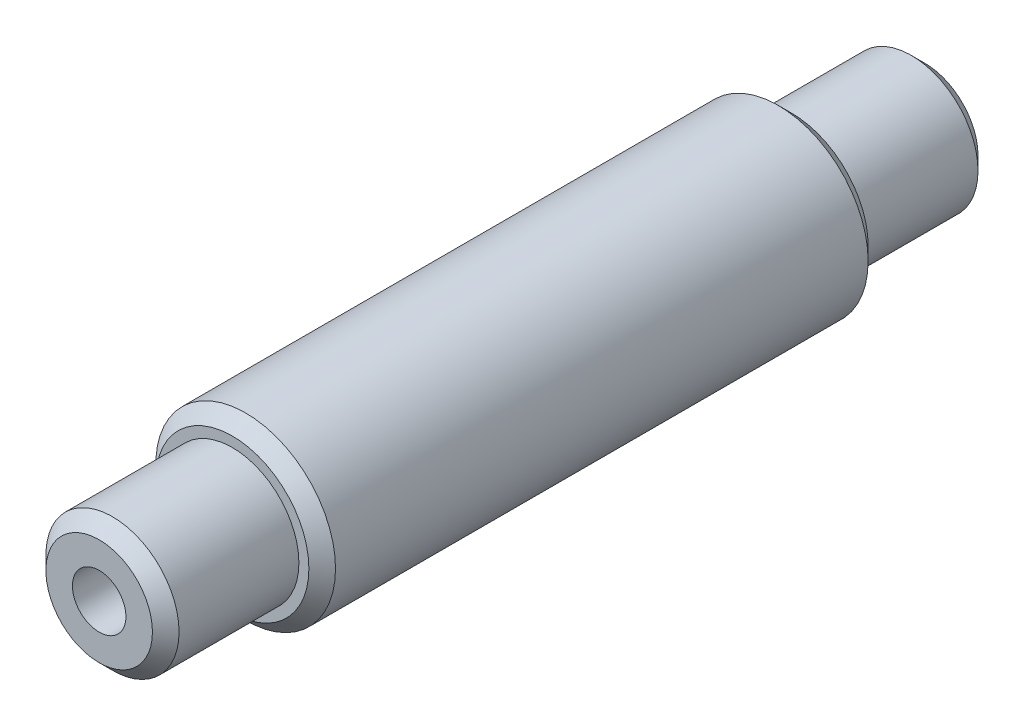
ISO-10303-21;
HEADER;
FILE_DESCRIPTION(('STEP AP214'),'2;1');
FILE_NAME('part.step','',(''),(''),'','','');
FILE_SCHEMA(('AUTOMOTIVE_DESIGN { 1 0 10303 214 1 1 1 1 }'));
ENDSEC;
DATA;
#1=APPLICATION_CONTEXT('core data for automotive mechanical design processes');
#2=APPLICATION_PROTOCOL_DEFINITION('international standard','automotive_design',2000,#1);
#3=PRODUCT_CONTEXT('',#1,'mechanical');
#4=PRODUCT('Part','Part','',(#3));
#5=PRODUCT_RELATED_PRODUCT_CATEGORY('part','',(#4));
#6=PRODUCT_DEFINITION_FORMATION('','',#4);
#7=PRODUCT_DEFINITION_CONTEXT('part definition',#1,'design');
#8=PRODUCT_DEFINITION('design','',#6,#7);
#9=PRODUCT_DEFINITION_SHAPE('','',#8);
#10=(LENGTH_UNIT() NAMED_UNIT(*) SI_UNIT(.MILLI.,.METRE.));
#11=(NAMED_UNIT(*) PLANE_ANGLE_UNIT() SI_UNIT($,.RADIAN.));
#12=(NAMED_UNIT(*) SI_UNIT($,.STERADIAN.) SOLID_ANGLE_UNIT());
#13=UNCERTAINTY_MEASURE_WITH_UNIT(LENGTH_MEASURE(1.E-05),#10,'distance_accuracy_value','');
#14=(GEOMETRIC_REPRESENTATION_CONTEXT(3) GLOBAL_UNCERTAINTY_ASSIGNED_CONTEXT((#13)) GLOBAL_UNIT_ASSIGNED_CONTEXT((#10,
#11,#12)) REPRESENTATION_CONTEXT('',''));
#15=CARTESIAN_POINT('',(0.,0.,0.));
#16=DIRECTION('',(0.,0.,1.));
#17=DIRECTION('',(1.,0.,0.));
#18=AXIS2_PLACEMENT_3D('',#15,#16,#17);
#19=CARTESIAN_POINT('',(0.,0.,26.67));
#20=DIRECTION('',(0.,0.,1.));
#21=DIRECTION('',(1.,0.,0.));
#22=AXIS2_PLACEMENT_3D('',#19,#20,#21);
#23=PLANE('',#22);
#24=CARTESIAN_POINT('',(0.,0.,26.67));
#25=DIRECTION('',(0.,0.,1.));
#26=DIRECTION('',(1.,0.,0.));
#27=AXIS2_PLACEMENT_3D('',#24,#25,#26);
#28=CIRCLE('',#27,7.30250000000001);
#29=CARTESIAN_POINT('',(7.30250000000001,0.,26.67));
#30=VERTEX_POINT('',#29);
#31=EDGE_CURVE('E94',#30,#30,#28,.T.);
#32=ORIENTED_EDGE('',*,*,#31,.T.);
#33=EDGE_LOOP('',(#32));
#34=FACE_BOUND('',#33,.T.);
#35=CARTESIAN_POINT('',(0.,0.,26.67));
#36=DIRECTION('',(0.,0.,1.));
#37=DIRECTION('',(1.,0.,0.));
#38=AXIS2_PLACEMENT_3D('',#35,#36,#37);
#39=CIRCLE('',#38,6.35);
#40=CARTESIAN_POINT('',(6.35,0.,26.67));
#41=VERTEX_POINT('',#40);
#42=EDGE_CURVE('E76',#41,#41,#39,.T.);
#43=ORIENTED_EDGE('',*,*,#42,.F.);
#44=EDGE_LOOP('',(#43));
#45=FACE_BOUND('',#44,.T.);
#46=ADVANCED_FACE('F38',(#34,#45),#23,.T.);
#47=CARTESIAN_POINT('',(0.,0.,-26.67));
#48=DIRECTION('',(0.,0.,1.));
#49=DIRECTION('',(1.,0.,0.));
#50=AXIS2_PLACEMENT_3D('',#47,#48,#49);
#51=PLANE('',#50);
#52=CARTESIAN_POINT('',(0.,0.,-26.67));
#53=DIRECTION('',(0.,0.,1.));
#54=DIRECTION('',(1.,0.,0.));
#55=AXIS2_PLACEMENT_3D('',#52,#53,#54);
#56=CIRCLE('',#55,7.3025);
#57=CARTESIAN_POINT('',(7.3025,0.,-26.67));
#58=VERTEX_POINT('',#57);
#59=EDGE_CURVE('E91',#58,#58,#56,.F.);
#60=ORIENTED_EDGE('',*,*,#59,.T.);
#61=EDGE_LOOP('',(#60));
#62=FACE_BOUND('',#61,.T.);
#63=CARTESIAN_POINT('',(0.,0.,-26.67));
#64=DIRECTION('',(0.,0.,1.));
#65=DIRECTION('',(1.,0.,0.));
#66=AXIS2_PLACEMENT_3D('',#63,#64,#65);
#67=CIRCLE('',#66,6.35);
#68=CARTESIAN_POINT('',(6.35,0.,-26.67));
#69=VERTEX_POINT('',#68);
#70=EDGE_CURVE('E73',#69,#69,#67,.F.);
#71=ORIENTED_EDGE('',*,*,#70,.F.);
#72=EDGE_LOOP('',(#71));
#73=FACE_BOUND('',#72,.T.);
#74=ADVANCED_FACE('F114',(#62,#73),#51,.F.);
#75=CARTESIAN_POINT('',(0.,0.,26.67));
#76=DIRECTION('',(0.,0.,-1.));
#77=DIRECTION('',(-1.,0.,0.));
#78=AXIS2_PLACEMENT_3D('',#75,#76,#77);
#79=CYLINDRICAL_SURFACE('',#78,8.5725);
#80=CARTESIAN_POINT('',(0.,0.,-25.4));
#81=DIRECTION('',(0.,0.,1.));
#82=DIRECTION('',(1.,0.,0.));
#83=AXIS2_PLACEMENT_3D('',#80,#81,#82);
#84=CIRCLE('',#83,8.5725);
#85=CARTESIAN_POINT('',(8.5725,0.,-25.4));
#86=VERTEX_POINT('',#85);
#87=EDGE_CURVE('E88',#86,#86,#84,.T.);
#88=ORIENTED_EDGE('',*,*,#87,.T.);
#89=EDGE_LOOP('',(#88));
#90=FACE_BOUND('',#89,.T.);
#91=CARTESIAN_POINT('',(0.,0.,25.4));
#92=DIRECTION('',(0.,0.,1.));
#93=DIRECTION('',(1.,0.,0.));
#94=AXIS2_PLACEMENT_3D('',#91,#92,#93);
#95=CIRCLE('',#94,8.5725);
#96=CARTESIAN_POINT('',(8.5725,0.,25.4));
#97=VERTEX_POINT('',#96);
#98=EDGE_CURVE('E85',#97,#97,#95,.F.);
#99=ORIENTED_EDGE('',*,*,#98,.T.);
#100=EDGE_LOOP('',(#99));
#101=FACE_BOUND('',#100,.T.);
#102=ADVANCED_FACE('F120',(#90,#101),#79,.T.);
#103=CARTESIAN_POINT('',(0.,0.,-39.37));
#104=DIRECTION('',(0.,0.,1.));
#105=DIRECTION('',(1.,0.,0.));
#106=AXIS2_PLACEMENT_3D('',#103,#104,#105);
#107=PLANE('',#106);
#108=CARTESIAN_POINT('',(0.,0.,-39.37));
#109=DIRECTION('',(0.,0.,-1.));
#110=DIRECTION('',(-1.,0.,0.));
#111=AXIS2_PLACEMENT_3D('',#108,#109,#110);
#112=CIRCLE('',#111,2.55269999999999);
#113=CARTESIAN_POINT('',(-2.55269999999999,0.,-39.37));
#114=VERTEX_POINT('',#113);
#115=EDGE_CURVE('E62',#114,#114,#112,.T.);
#116=ORIENTED_EDGE('',*,*,#115,.F.);
#117=EDGE_LOOP('',(#116));
#118=FACE_BOUND('',#117,.T.);
#119=CARTESIAN_POINT('',(0.,0.,-39.37));
#120=DIRECTION('',(0.,0.,1.));
#121=DIRECTION('',(1.,0.,0.));
#122=AXIS2_PLACEMENT_3D('',#119,#120,#121);
#123=CIRCLE('',#122,5.07999999999999);
#124=CARTESIAN_POINT('',(5.07999999999999,0.,-39.37));
#125=VERTEX_POINT('',#124);
#126=EDGE_CURVE('E82',#125,#125,#123,.F.);
#127=ORIENTED_EDGE('',*,*,#126,.T.);
#128=EDGE_LOOP('',(#127));
#129=FACE_BOUND('',#128,.T.);
#130=ADVANCED_FACE('F130',(#118,#129),#107,.F.);
#131=CARTESIAN_POINT('',(0.,0.,39.37));
#132=DIRECTION('',(0.,0.,-1.));
#133=DIRECTION('',(-1.,0.,0.));
#134=AXIS2_PLACEMENT_3D('',#131,#132,#133);
#135=CYLINDRICAL_SURFACE('',#134,6.35);
#136=CARTESIAN_POINT('',(0.,0.,-38.1));
#137=DIRECTION('',(0.,0.,1.));
#138=DIRECTION('',(1.,0.,0.));
#139=AXIS2_PLACEMENT_3D('',#136,#137,#138);
#140=CIRCLE('',#139,6.35);
#141=CARTESIAN_POINT('',(6.35,0.,-38.1));
#142=VERTEX_POINT('',#141);
#143=EDGE_CURVE('E79',#142,#142,#140,.T.);
#144=ORIENTED_EDGE('',*,*,#143,.T.);
#145=EDGE_LOOP('',(#144));
#146=FACE_BOUND('',#145,.T.);
#147=ORIENTED_EDGE('',*,*,#70,.T.);
#148=EDGE_LOOP('',(#147));
#149=FACE_BOUND('',#148,.T.);
#150=ADVANCED_FACE('F150',(#146,#149),#135,.T.);
#151=CARTESIAN_POINT('',(0.,0.,38.1));
#152=DIRECTION('',(0.,0.,1.));
#153=DIRECTION('',(1.,0.,0.));
#154=AXIS2_PLACEMENT_3D('',#151,#152,#153);
#155=CIRCLE('',#154,6.35);
#156=CARTESIAN_POINT('',(6.35,0.,38.1));
#157=VERTEX_POINT('',#156);
#158=EDGE_CURVE('E11',#157,#157,#155,.F.);
#159=ORIENTED_EDGE('',*,*,#158,.T.);
#160=EDGE_LOOP('',(#159));
#161=FACE_BOUND('',#160,.T.);
#162=ORIENTED_EDGE('',*,*,#42,.T.);
#163=EDGE_LOOP('',(#162));
#164=FACE_BOUND('',#163,.T.);
#165=ADVANCED_FACE('F125',(#161,#164),#135,.T.);
#166=CARTESIAN_POINT('',(0.,0.,39.37));
#167=DIRECTION('',(0.,0.,1.));
#168=DIRECTION('',(1.,0.,0.));
#169=AXIS2_PLACEMENT_3D('',#166,#167,#168);
#170=PLANE('',#169);
#171=CARTESIAN_POINT('',(0.,0.,39.37));
#172=DIRECTION('',(0.,0.,1.));
#173=DIRECTION('',(1.,0.,0.));
#174=AXIS2_PLACEMENT_3D('',#171,#172,#173);
#175=CIRCLE('',#174,2.55269999999999);
#176=CARTESIAN_POINT('',(2.55269999999999,0.,39.37));
#177=VERTEX_POINT('',#176);
#178=EDGE_CURVE('E63',#177,#177,#175,.T.);
#179=ORIENTED_EDGE('',*,*,#178,.F.);
#180=EDGE_LOOP('',(#179));
#181=FACE_BOUND('',#180,.T.);
#182=CARTESIAN_POINT('',(0.,0.,39.37));
#183=DIRECTION('',(0.,0.,1.));
#184=DIRECTION('',(1.,0.,0.));
#185=AXIS2_PLACEMENT_3D('',#182,#183,#184);
#186=CIRCLE('',#185,5.08000000000002);
#187=CARTESIAN_POINT('',(5.08000000000002,0.,39.37));
#188=VERTEX_POINT('',#187);
#189=EDGE_CURVE('E46',#188,#188,#186,.T.);
#190=ORIENTED_EDGE('',*,*,#189,.T.);
#191=EDGE_LOOP('',(#190));
#192=FACE_BOUND('',#191,.T.);
#193=ADVANCED_FACE('F99',(#181,#192),#170,.T.);
#194=CARTESIAN_POINT('',(0.,0.,-38.1));
#195=DIRECTION('',(0.,0.,1.));
#196=DIRECTION('',(1.,0.,0.));
#197=AXIS2_PLACEMENT_3D('',#194,#195,#196);
#198=CONICAL_SURFACE('',#197,6.35,0.785398163397456);
#199=ORIENTED_EDGE('',*,*,#126,.F.);
#200=EDGE_LOOP('',(#199));
#201=FACE_BOUND('',#200,.T.);
#202=ORIENTED_EDGE('',*,*,#143,.F.);
#203=EDGE_LOOP('',(#202));
#204=FACE_BOUND('',#203,.T.);
#205=ADVANCED_FACE('F132',(#201,#204),#198,.T.);
#206=CARTESIAN_POINT('',(0.,0.,-25.4));
#207=DIRECTION('',(0.,0.,1.));
#208=DIRECTION('',(1.,0.,0.));
#209=AXIS2_PLACEMENT_3D('',#206,#207,#208);
#210=CONICAL_SURFACE('',#209,8.5725,0.78539816339745);
#211=ORIENTED_EDGE('',*,*,#59,.F.);
#212=EDGE_LOOP('',(#211));
#213=FACE_BOUND('',#212,.T.);
#214=ORIENTED_EDGE('',*,*,#87,.F.);
#215=EDGE_LOOP('',(#214));
#216=FACE_BOUND('',#215,.T.);
#217=ADVANCED_FACE('F110',(#213,#216),#210,.T.);
#218=CARTESIAN_POINT('',(0.,0.,26.67));
#219=DIRECTION('',(0.,0.,-1.));
#220=DIRECTION('',(-1.,0.,0.));
#221=AXIS2_PLACEMENT_3D('',#218,#219,#220);
#222=CONICAL_SURFACE('',#221,7.30250000000001,0.78539816339745);
#223=ORIENTED_EDGE('',*,*,#98,.F.);
#224=EDGE_LOOP('',(#223));
#225=FACE_BOUND('',#224,.T.);
#226=ORIENTED_EDGE('',*,*,#31,.F.);
#227=EDGE_LOOP('',(#226));
#228=FACE_BOUND('',#227,.T.);
#229=ADVANCED_FACE('F103',(#225,#228),#222,.T.);
#230=CARTESIAN_POINT('',(0.,0.,39.37));
#231=DIRECTION('',(0.,0.,-1.));
#232=DIRECTION('',(-1.,0.,0.));
#233=AXIS2_PLACEMENT_3D('',#230,#231,#232);
#234=CONICAL_SURFACE('',#233,5.08000000000002,0.785398163397445);
#235=ORIENTED_EDGE('',*,*,#158,.F.);
#236=EDGE_LOOP('',(#235));
#237=FACE_BOUND('',#236,.T.);
#238=ORIENTED_EDGE('',*,*,#189,.F.);
#239=EDGE_LOOP('',(#238));
#240=FACE_BOUND('',#239,.T.);
#241=ADVANCED_FACE('F40',(#237,#240),#234,.T.);
#242=CARTESIAN_POINT('',(0.,0.,-13.97));
#243=DIRECTION('',(0.,0.,-1.));
#244=DIRECTION('',(-1.,0.,0.));
#245=AXIS2_PLACEMENT_3D('',#242,#243,#244);
#246=CONICAL_SURFACE('',#245,2.55269999999999,1.02974425867665);
#247=CARTESIAN_POINT('',(0.,0.,-12.4361830978083));
#248=VERTEX_POINT('',#247);
#249=VERTEX_LOOP('',#248);
#250=FACE_BOUND('',#249,.T.);
#251=CARTESIAN_POINT('',(0.,0.,-13.97));
#252=DIRECTION('',(0.,0.,-1.));
#253=DIRECTION('',(-1.,0.,0.));
#254=AXIS2_PLACEMENT_3D('',#251,#252,#253);
#255=CIRCLE('',#254,2.55269999999999);
#256=CARTESIAN_POINT('',(-2.55269999999999,0.,-13.97));
#257=VERTEX_POINT('',#256);
#258=EDGE_CURVE('E66',#257,#257,#255,.T.);
#259=ORIENTED_EDGE('',*,*,#258,.T.);
#260=EDGE_LOOP('',(#259));
#261=FACE_BOUND('',#260,.T.);
#262=ADVANCED_FACE('F102',(#250,#261),#246,.F.);
#263=CARTESIAN_POINT('',(0.,0.,-39.37));
#264=DIRECTION('',(0.,0.,-1.));
#265=DIRECTION('',(-1.,0.,0.));
#266=AXIS2_PLACEMENT_3D('',#263,#264,#265);
#267=CYLINDRICAL_SURFACE('',#266,2.55269999999999);
#268=ORIENTED_EDGE('',*,*,#258,.F.);
#269=EDGE_LOOP('',(#268));
#270=FACE_BOUND('',#269,.T.);
#271=ORIENTED_EDGE('',*,*,#115,.T.);
#272=EDGE_LOOP('',(#271));
#273=FACE_BOUND('',#272,.T.);
#274=ADVANCED_FACE('F56',(#270,#273),#267,.F.);
#275=CARTESIAN_POINT('',(0.,0.,13.97));
#276=DIRECTION('',(0.,0.,1.));
#277=DIRECTION('',(1.,0.,0.));
#278=AXIS2_PLACEMENT_3D('',#275,#276,#277);
#279=CONICAL_SURFACE('',#278,2.55269999999999,1.02974425867665);
#280=CARTESIAN_POINT('',(0.,0.,12.4361830978083));
#281=VERTEX_POINT('',#280);
#282=VERTEX_LOOP('',#281);
#283=FACE_BOUND('',#282,.T.);
#284=CARTESIAN_POINT('',(0.,0.,13.97));
#285=DIRECTION('',(0.,0.,1.));
#286=DIRECTION('',(1.,0.,0.));
#287=AXIS2_PLACEMENT_3D('',#284,#285,#286);
#288=CIRCLE('',#287,2.55269999999999);
#289=CARTESIAN_POINT('',(2.55269999999999,0.,13.97));
#290=VERTEX_POINT('',#289);
#291=EDGE_CURVE('E60',#290,#290,#288,.T.);
#292=ORIENTED_EDGE('',*,*,#291,.T.);
#293=EDGE_LOOP('',(#292));
#294=FACE_BOUND('',#293,.T.);
#295=ADVANCED_FACE('F52',(#283,#294),#279,.F.);
#296=CARTESIAN_POINT('',(0.,0.,39.37));
#297=DIRECTION('',(0.,0.,1.));
#298=DIRECTION('',(1.,0.,0.));
#299=AXIS2_PLACEMENT_3D('',#296,#297,#298);
#300=CYLINDRICAL_SURFACE('',#299,2.55269999999999);
#301=ORIENTED_EDGE('',*,*,#291,.F.);
#302=EDGE_LOOP('',(#301));
#303=FACE_BOUND('',#302,.T.);
#304=ORIENTED_EDGE('',*,*,#178,.T.);
#305=EDGE_LOOP('',(#304));
#306=FACE_BOUND('',#305,.T.);
#307=ADVANCED_FACE('F55',(#303,#306),#300,.F.);
#308=CLOSED_SHELL('',(#46,#74,#102,#130,#150,#165,#193,#205,#217,#229,#241,#262,#274,#295,#307));
#309=MANIFOLD_SOLID_BREP('B2',#308);
#310=ADVANCED_BREP_SHAPE_REPRESENTATION('',(#18,#309),#14);
#311=SHAPE_DEFINITION_REPRESENTATION(#9,#310);
ENDSEC;
END-ISO-10303-21;
